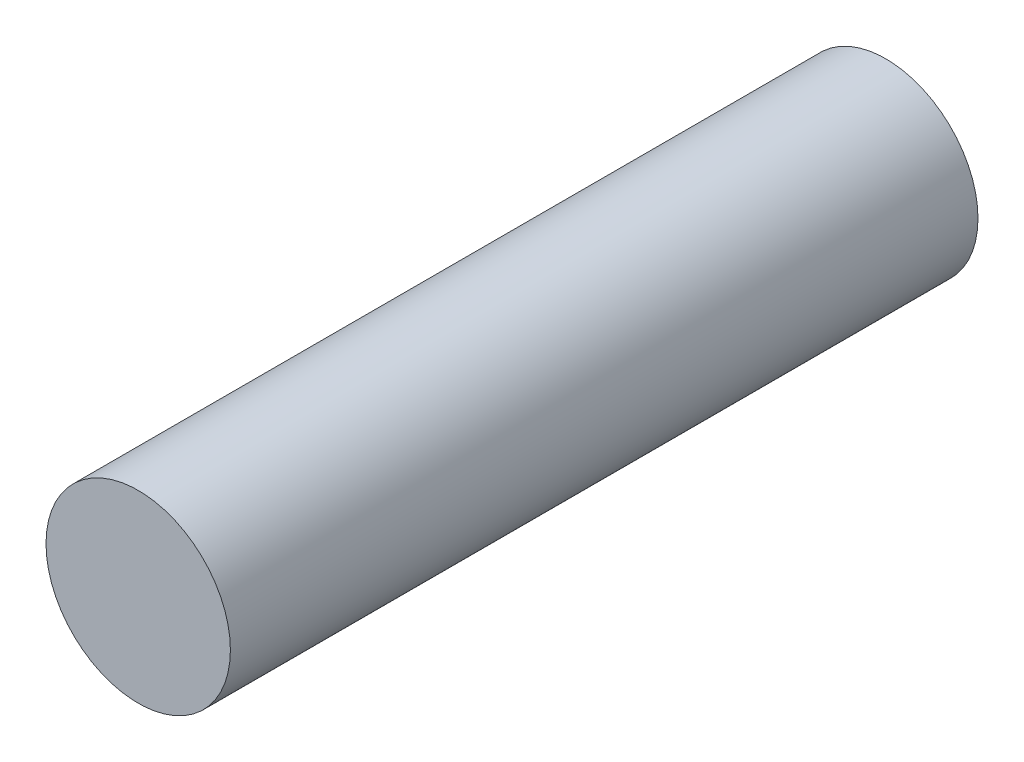
ISO-10303-21;
HEADER;
FILE_DESCRIPTION(('STEP AP214'),'2;1');
FILE_NAME('part.step','',(''),(''),'','','');
FILE_SCHEMA(('AUTOMOTIVE_DESIGN { 1 0 10303 214 1 1 1 1 }'));
ENDSEC;
DATA;
#1=APPLICATION_CONTEXT('core data for automotive mechanical design processes');
#2=APPLICATION_PROTOCOL_DEFINITION('international standard','automotive_design',2000,#1);
#3=PRODUCT_CONTEXT('',#1,'mechanical');
#4=PRODUCT('Part','Part','',(#3));
#5=PRODUCT_RELATED_PRODUCT_CATEGORY('part','',(#4));
#6=PRODUCT_DEFINITION_FORMATION('','',#4);
#7=PRODUCT_DEFINITION_CONTEXT('part definition',#1,'design');
#8=PRODUCT_DEFINITION('design','',#6,#7);
#9=PRODUCT_DEFINITION_SHAPE('','',#8);
#10=(LENGTH_UNIT() NAMED_UNIT(*) SI_UNIT(.MILLI.,.METRE.));
#11=(NAMED_UNIT(*) PLANE_ANGLE_UNIT() SI_UNIT($,.RADIAN.));
#12=(NAMED_UNIT(*) SI_UNIT($,.STERADIAN.) SOLID_ANGLE_UNIT());
#13=UNCERTAINTY_MEASURE_WITH_UNIT(LENGTH_MEASURE(1.E-05),#10,'distance_accuracy_value','');
#14=(GEOMETRIC_REPRESENTATION_CONTEXT(3) GLOBAL_UNCERTAINTY_ASSIGNED_CONTEXT((#13)) GLOBAL_UNIT_ASSIGNED_CONTEXT((#10,
#11,#12)) REPRESENTATION_CONTEXT('',''));
#15=CARTESIAN_POINT('',(0.,0.,0.));
#16=DIRECTION('',(0.,0.,1.));
#17=DIRECTION('',(1.,0.,0.));
#18=AXIS2_PLACEMENT_3D('',#15,#16,#17);
#19=CARTESIAN_POINT('',(0.,0.,34.29));
#20=DIRECTION('',(0.,0.,-1.));
#21=DIRECTION('',(-1.,0.,0.));
#22=AXIS2_PLACEMENT_3D('',#19,#20,#21);
#23=CYLINDRICAL_SURFACE('',#22,3.7592);
#24=CARTESIAN_POINT('',(0.,0.,34.29));
#25=DIRECTION('',(0.,0.,1.));
#26=DIRECTION('',(1.,0.,0.));
#27=AXIS2_PLACEMENT_3D('',#24,#25,#26);
#28=CIRCLE('',#27,3.7592);
#29=CARTESIAN_POINT('',(3.7592,0.,34.29));
#30=VERTEX_POINT('',#29);
#31=EDGE_CURVE('E10',#30,#30,#28,.T.);
#32=ORIENTED_EDGE('',*,*,#31,.F.);
#33=EDGE_LOOP('',(#32));
#34=FACE_BOUND('',#33,.T.);
#35=CARTESIAN_POINT('',(0.,0.,3.81));
#36=DIRECTION('',(0.,0.,1.));
#37=DIRECTION('',(1.,0.,0.));
#38=AXIS2_PLACEMENT_3D('',#35,#36,#37);
#39=CIRCLE('',#38,3.7592);
#40=CARTESIAN_POINT('',(3.7592,0.,3.81));
#41=VERTEX_POINT('',#40);
#42=EDGE_CURVE('E40',#41,#41,#39,.T.);
#43=ORIENTED_EDGE('',*,*,#42,.T.);
#44=EDGE_LOOP('',(#43));
#45=FACE_BOUND('',#44,.T.);
#46=ADVANCED_FACE('F37',(#34,#45),#23,.T.);
#47=CARTESIAN_POINT('',(0.,0.,34.29));
#48=DIRECTION('',(0.,0.,1.));
#49=DIRECTION('',(1.,0.,0.));
#50=AXIS2_PLACEMENT_3D('',#47,#48,#49);
#51=PLANE('',#50);
#52=ORIENTED_EDGE('',*,*,#31,.T.);
#53=EDGE_LOOP('',(#52));
#54=FACE_BOUND('',#53,.T.);
#55=ADVANCED_FACE('F54',(#54),#51,.T.);
#56=CARTESIAN_POINT('',(0.,0.,3.81));
#57=DIRECTION('',(0.,0.,1.));
#58=DIRECTION('',(1.,0.,0.));
#59=AXIS2_PLACEMENT_3D('',#56,#57,#58);
#60=PLANE('',#59);
#61=ORIENTED_EDGE('',*,*,#42,.F.);
#62=EDGE_LOOP('',(#61));
#63=FACE_BOUND('',#62,.T.);
#64=ADVANCED_FACE('F52',(#63),#60,.F.);
#65=CLOSED_SHELL('',(#46,#55,#64));
#66=MANIFOLD_SOLID_BREP('B2',#65);
#67=ADVANCED_BREP_SHAPE_REPRESENTATION('',(#18,#66),#14);
#68=SHAPE_DEFINITION_REPRESENTATION(#9,#67);
ENDSEC;
END-ISO-10303-21;
